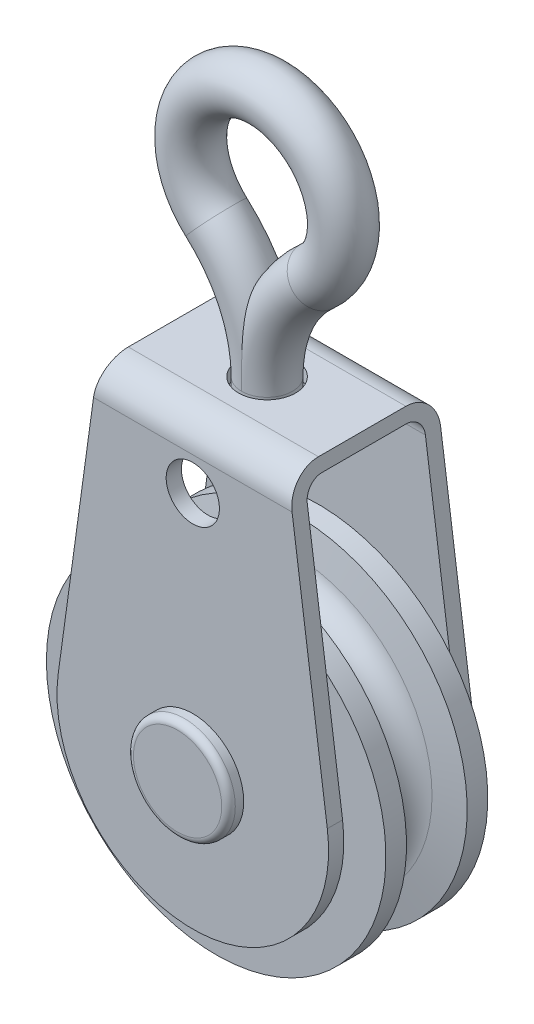
ISO-10303-21;
HEADER;
FILE_DESCRIPTION(('STEP AP214'),'2;1');
FILE_NAME('part.step','',(''),(''),'','','');
FILE_SCHEMA(('AUTOMOTIVE_DESIGN { 1 0 10303 214 1 1 1 1 }'));
ENDSEC;
DATA;
#1=APPLICATION_CONTEXT('core data for automotive mechanical design processes');
#2=APPLICATION_PROTOCOL_DEFINITION('international standard','automotive_design',2000,#1);
#3=PRODUCT_CONTEXT('',#1,'mechanical');
#4=PRODUCT('Part','Part','',(#3));
#5=PRODUCT_RELATED_PRODUCT_CATEGORY('part','',(#4));
#6=PRODUCT_DEFINITION_FORMATION('','',#4);
#7=PRODUCT_DEFINITION_CONTEXT('part definition',#1,'design');
#8=PRODUCT_DEFINITION('design','',#6,#7);
#9=PRODUCT_DEFINITION_SHAPE('','',#8);
#10=(LENGTH_UNIT() NAMED_UNIT(*) SI_UNIT(.MILLI.,.METRE.));
#11=(NAMED_UNIT(*) PLANE_ANGLE_UNIT() SI_UNIT($,.RADIAN.));
#12=(NAMED_UNIT(*) SI_UNIT($,.STERADIAN.) SOLID_ANGLE_UNIT());
#13=UNCERTAINTY_MEASURE_WITH_UNIT(LENGTH_MEASURE(1.E-05),#10,'distance_accuracy_value','');
#14=(GEOMETRIC_REPRESENTATION_CONTEXT(3) GLOBAL_UNCERTAINTY_ASSIGNED_CONTEXT((#13)) GLOBAL_UNIT_ASSIGNED_CONTEXT((#10,
#11,#12)) REPRESENTATION_CONTEXT('',''));
#15=CARTESIAN_POINT('',(0.,0.,0.));
#16=DIRECTION('',(0.,0.,1.));
#17=DIRECTION('',(1.,0.,0.));
#18=AXIS2_PLACEMENT_3D('',#15,#16,#17);
#19=CARTESIAN_POINT('',(0.,27.305,0.));
#20=DIRECTION('',(0.,-1.,0.));
#21=DIRECTION('',(0.,0.,-1.));
#22=AXIS2_PLACEMENT_3D('',#19,#20,#21);
#23=PLANE('',#22);
#24=CARTESIAN_POINT('',(0.,27.305,0.));
#25=DIRECTION('',(0.,1.,0.));
#26=DIRECTION('',(0.,0.,1.));
#27=AXIS2_PLACEMENT_3D('',#24,#25,#26);
#28=CIRCLE('',#27,2.667);
#29=CARTESIAN_POINT('',(0.,27.305,2.667));
#30=VERTEX_POINT('',#29);
#31=EDGE_CURVE('E225',#30,#30,#28,.T.);
#32=ORIENTED_EDGE('',*,*,#31,.T.);
#33=EDGE_LOOP('',(#32));
#34=FACE_BOUND('',#33,.T.);
#35=CARTESIAN_POINT('',(0.,27.305,0.));
#36=DIRECTION('',(0.,-1.,0.));
#37=DIRECTION('',(0.,0.,-1.));
#38=AXIS2_PLACEMENT_3D('',#35,#36,#37);
#39=CIRCLE('',#38,2.38125);
#40=CARTESIAN_POINT('',(0.,27.305,-2.38125));
#41=VERTEX_POINT('',#40);
#42=EDGE_CURVE('E11',#41,#41,#39,.F.);
#43=ORIENTED_EDGE('',*,*,#42,.F.);
#44=EDGE_LOOP('',(#43));
#45=FACE_BOUND('',#44,.T.);
#46=ADVANCED_FACE('F41',(#34,#45),#23,.F.);
#47=CARTESIAN_POINT('',(9.0646453448014,27.305,18.1737195122));
#48=DIRECTION('',(0.,1.,0.));
#49=DIRECTION('',(0.,0.,-1.));
#50=AXIS2_PLACEMENT_3D('',#47,#48,#49);
#51=PLANE('',#50);
#52=DIRECTION('',(-1.,0.,0.));
#53=VECTOR('',#52,1.);
#54=CARTESIAN_POINT('',(-9.0646453448014,27.305,3.937));
#55=LINE('',#54,#53);
#56=CARTESIAN_POINT('',(9.0646453448014,27.305,3.937));
#57=VERTEX_POINT('',#56);
#58=CARTESIAN_POINT('',(0.501006549358368,27.305,3.937));
#59=VERTEX_POINT('',#58);
#60=EDGE_CURVE('E282',#57,#59,#55,.T.);
#61=ORIENTED_EDGE('',*,*,#60,.T.);
#62=CARTESIAN_POINT('',(0.,27.305,0.));
#63=DIRECTION('',(0.,-1.,0.));
#64=DIRECTION('',(0.,0.,-1.));
#65=AXIS2_PLACEMENT_3D('',#62,#63,#64);
#66=CIRCLE('',#65,3.96875);
#67=CARTESIAN_POINT('',(0.501006549358367,27.305,-3.937));
#68=VERTEX_POINT('',#67);
#69=EDGE_CURVE('E62',#68,#59,#66,.T.);
#70=ORIENTED_EDGE('',*,*,#69,.F.);
#71=DIRECTION('',(-1.,0.,0.));
#72=VECTOR('',#71,1.);
#73=CARTESIAN_POINT('',(-9.0646453448014,27.305,-3.937));
#74=LINE('',#73,#72);
#75=CARTESIAN_POINT('',(9.0646453448014,27.305,-3.937));
#76=VERTEX_POINT('',#75);
#77=EDGE_CURVE('E236',#76,#68,#74,.T.);
#78=ORIENTED_EDGE('',*,*,#77,.F.);
#79=DIRECTION('',(0.,0.,-1.));
#80=VECTOR('',#79,1.);
#81=CARTESIAN_POINT('',(9.0646453448014,27.305,18.1737195122));
#82=LINE('',#81,#80);
#83=EDGE_CURVE('E224',#57,#76,#82,.T.);
#84=ORIENTED_EDGE('',*,*,#83,.F.);
#85=EDGE_LOOP('',(#61,#70,#78,#84));
#86=FACE_BOUND('',#85,.T.);
#87=ADVANCED_FACE('F280',(#86),#51,.F.);
#88=CARTESIAN_POINT('',(0.,0.,-17.5691305089622));
#89=DIRECTION('',(0.,0.,1.));
#90=DIRECTION('',(1.,0.,0.));
#91=AXIS2_PLACEMENT_3D('',#88,#89,#90);
#92=CYLINDRICAL_SURFACE('',#91,2.8575);
#93=CARTESIAN_POINT('',(0.,0.,-4.7625));
#94=DIRECTION('',(0.,0.,-1.));
#95=DIRECTION('',(-1.,0.,0.));
#96=AXIS2_PLACEMENT_3D('',#93,#94,#95);
#97=CIRCLE('',#96,2.8575);
#98=CARTESIAN_POINT('',(-2.8575,0.,-4.7625));
#99=VERTEX_POINT('',#98);
#100=EDGE_CURVE('E388',#99,#99,#97,.F.);
#101=ORIENTED_EDGE('',*,*,#100,.F.);
#102=EDGE_LOOP('',(#101));
#103=FACE_BOUND('',#102,.T.);
#104=CARTESIAN_POINT('',(0.,0.,-5.5245));
#105=DIRECTION('',(0.,0.,-1.));
#106=DIRECTION('',(-1.,0.,0.));
#107=AXIS2_PLACEMENT_3D('',#104,#105,#106);
#108=CIRCLE('',#107,2.8575);
#109=CARTESIAN_POINT('',(-2.8575,0.,-5.5245));
#110=VERTEX_POINT('',#109);
#111=EDGE_CURVE('E417',#110,#110,#108,.T.);
#112=ORIENTED_EDGE('',*,*,#111,.F.);
#113=EDGE_LOOP('',(#112));
#114=FACE_BOUND('',#113,.T.);
#115=ADVANCED_FACE('F482',(#103,#114),#92,.T.);
#116=CARTESIAN_POINT('',(-1.10854532508269E-13,-15.875,4.7625));
#117=DIRECTION('',(0.,0.,1.));
#118=DIRECTION('',(1.,0.,0.));
#119=AXIS2_PLACEMENT_3D('',#116,#117,#118);
#120=PLANE('',#119);
#121=CARTESIAN_POINT('',(0.,0.,4.7625));
#122=DIRECTION('',(0.,0.,-1.));
#123=DIRECTION('',(-1.,0.,0.));
#124=AXIS2_PLACEMENT_3D('',#121,#122,#123);
#125=CIRCLE('',#124,15.875);
#126=CARTESIAN_POINT('',(-15.875,0.,4.7625));
#127=VERTEX_POINT('',#126);
#128=EDGE_CURVE('E393',#127,#127,#125,.T.);
#129=ORIENTED_EDGE('',*,*,#128,.F.);
#130=EDGE_LOOP('',(#129));
#131=FACE_BOUND('',#130,.T.);
#132=CARTESIAN_POINT('',(0.,0.,4.7625));
#133=DIRECTION('',(0.,0.,1.));
#134=DIRECTION('',(1.,0.,0.));
#135=AXIS2_PLACEMENT_3D('',#132,#133,#134);
#136=CIRCLE('',#135,2.8575);
#137=CARTESIAN_POINT('',(2.8575,0.,4.7625));
#138=VERTEX_POINT('',#137);
#139=EDGE_CURVE('E389',#138,#138,#136,.F.);
#140=ORIENTED_EDGE('',*,*,#139,.T.);
#141=EDGE_LOOP('',(#140));
#142=FACE_BOUND('',#141,.T.);
#143=ADVANCED_FACE('F43',(#131,#142),#120,.T.);
#144=CARTESIAN_POINT('',(-1.10854532508269E-13,-15.875,-4.7625));
#145=DIRECTION('',(0.,0.,-1.));
#146=DIRECTION('',(-1.,0.,0.));
#147=AXIS2_PLACEMENT_3D('',#144,#145,#146);
#148=PLANE('',#147);
#149=CARTESIAN_POINT('',(0.,0.,-4.7625));
#150=DIRECTION('',(0.,0.,-1.));
#151=DIRECTION('',(-1.,0.,0.));
#152=AXIS2_PLACEMENT_3D('',#149,#150,#151);
#153=CIRCLE('',#152,15.875);
#154=CARTESIAN_POINT('',(-15.875,0.,-4.7625));
#155=VERTEX_POINT('',#154);
#156=EDGE_CURVE('E413',#155,#155,#153,.T.);
#157=ORIENTED_EDGE('',*,*,#156,.T.);
#158=EDGE_LOOP('',(#157));
#159=FACE_BOUND('',#158,.T.);
#160=ORIENTED_EDGE('',*,*,#100,.T.);
#161=EDGE_LOOP('',(#160));
#162=FACE_BOUND('',#161,.T.);
#163=ADVANCED_FACE('F718',(#159,#162),#148,.T.);
#164=CARTESIAN_POINT('',(0.,0.,-4.7625));
#165=DIRECTION('',(0.,0.,-1.));
#166=DIRECTION('',(-1.,0.,0.));
#167=AXIS2_PLACEMENT_3D('',#164,#165,#166);
#168=CYLINDRICAL_SURFACE('',#167,15.875);
#169=CARTESIAN_POINT('',(0.,0.,-2.83786324236497));
#170=DIRECTION('',(0.,0.,-1.));
#171=DIRECTION('',(-1.,0.,0.));
#172=AXIS2_PLACEMENT_3D('',#169,#170,#171);
#173=CIRCLE('',#172,15.875);
#174=CARTESIAN_POINT('',(-15.875,0.,-2.83786324236497));
#175=VERTEX_POINT('',#174);
#176=EDGE_CURVE('E409',#175,#175,#173,.T.);
#177=ORIENTED_EDGE('',*,*,#176,.T.);
#178=EDGE_LOOP('',(#177));
#179=FACE_BOUND('',#178,.T.);
#180=ORIENTED_EDGE('',*,*,#156,.F.);
#181=EDGE_LOOP('',(#180));
#182=FACE_BOUND('',#181,.T.);
#183=ADVANCED_FACE('F723',(#179,#182),#168,.T.);
#184=CARTESIAN_POINT('',(0.,0.,-2.83786324236497));
#185=DIRECTION('',(0.,0.,-1.));
#186=DIRECTION('',(-1.,0.,0.));
#187=AXIS2_PLACEMENT_3D('',#184,#185,#186);
#188=CONICAL_SURFACE('',#187,15.875,1.39626340159546);
#189=CARTESIAN_POINT('',(0.,0.,-2.34507346186032));
#190=DIRECTION('',(0.,0.,-1.));
#191=DIRECTION('',(-1.,0.,0.));
#192=AXIS2_PLACEMENT_3D('',#189,#190,#191);
#193=CIRCLE('',#192,13.0802502769306);
#194=CARTESIAN_POINT('',(-13.0802502769306,0.,-2.34507346186032));
#195=VERTEX_POINT('',#194);
#196=EDGE_CURVE('E405',#195,#195,#193,.T.);
#197=ORIENTED_EDGE('',*,*,#196,.T.);
#198=EDGE_LOOP('',(#197));
#199=FACE_BOUND('',#198,.T.);
#200=ORIENTED_EDGE('',*,*,#176,.F.);
#201=EDGE_LOOP('',(#200));
#202=FACE_BOUND('',#201,.T.);
#203=ADVANCED_FACE('F737',(#199,#202),#188,.T.);
#204=CARTESIAN_POINT('',(0.,0.,0.));
#205=DIRECTION('',(0.,0.,-1.));
#206=DIRECTION('',(-1.,0.,0.));
#207=AXIS2_PLACEMENT_3D('',#204,#205,#206);
#208=TOROIDAL_SURFACE('',#207,13.49375,2.38125);
#209=CARTESIAN_POINT('',(0.,0.,2.34507346186032));
#210=DIRECTION('',(0.,0.,-1.));
#211=DIRECTION('',(-1.,0.,0.));
#212=AXIS2_PLACEMENT_3D('',#209,#210,#211);
#213=CIRCLE('',#212,13.0802502769306);
#214=CARTESIAN_POINT('',(-13.0802502769306,0.,2.34507346186032));
#215=VERTEX_POINT('',#214);
#216=EDGE_CURVE('E401',#215,#215,#213,.T.);
#217=ORIENTED_EDGE('',*,*,#216,.T.);
#218=EDGE_LOOP('',(#217));
#219=FACE_BOUND('',#218,.T.);
#220=ORIENTED_EDGE('',*,*,#196,.F.);
#221=EDGE_LOOP('',(#220));
#222=FACE_BOUND('',#221,.T.);
#223=ADVANCED_FACE('F731',(#219,#222),#208,.F.);
#224=CARTESIAN_POINT('',(0.,0.,2.34507346186032));
#225=DIRECTION('',(0.,0.,1.));
#226=DIRECTION('',(1.,0.,0.));
#227=AXIS2_PLACEMENT_3D('',#224,#225,#226);
#228=CONICAL_SURFACE('',#227,13.0802502769306,1.39626340159546);
#229=CARTESIAN_POINT('',(0.,0.,2.83786324236497));
#230=DIRECTION('',(0.,0.,-1.));
#231=DIRECTION('',(-1.,0.,0.));
#232=AXIS2_PLACEMENT_3D('',#229,#230,#231);
#233=CIRCLE('',#232,15.875);
#234=CARTESIAN_POINT('',(-15.875,0.,2.83786324236497));
#235=VERTEX_POINT('',#234);
#236=EDGE_CURVE('E397',#235,#235,#233,.T.);
#237=ORIENTED_EDGE('',*,*,#236,.T.);
#238=EDGE_LOOP('',(#237));
#239=FACE_BOUND('',#238,.T.);
#240=ORIENTED_EDGE('',*,*,#216,.F.);
#241=EDGE_LOOP('',(#240));
#242=FACE_BOUND('',#241,.T.);
#243=ADVANCED_FACE('F709',(#239,#242),#228,.T.);
#244=CARTESIAN_POINT('',(0.,0.,-4.7625));
#245=DIRECTION('',(0.,0.,-1.));
#246=DIRECTION('',(-1.,0.,0.));
#247=AXIS2_PLACEMENT_3D('',#244,#245,#246);
#248=CYLINDRICAL_SURFACE('',#247,15.875);
#249=ORIENTED_EDGE('',*,*,#128,.T.);
#250=EDGE_LOOP('',(#249));
#251=FACE_BOUND('',#250,.T.);
#252=ORIENTED_EDGE('',*,*,#236,.F.);
#253=EDGE_LOOP('',(#252));
#254=FACE_BOUND('',#253,.T.);
#255=ADVANCED_FACE('F702',(#251,#254),#248,.T.);
#256=ORIENTED_EDGE('',*,*,#139,.F.);
#257=EDGE_LOOP('',(#256));
#258=FACE_BOUND('',#257,.T.);
#259=CARTESIAN_POINT('',(0.,0.,5.5245));
#260=DIRECTION('',(0.,0.,1.));
#261=DIRECTION('',(1.,0.,0.));
#262=AXIS2_PLACEMENT_3D('',#259,#260,#261);
#263=CIRCLE('',#262,2.8575);
#264=CARTESIAN_POINT('',(2.8575,0.,5.5245));
#265=VERTEX_POINT('',#264);
#266=EDGE_CURVE('E355',#265,#265,#263,.T.);
#267=ORIENTED_EDGE('',*,*,#266,.F.);
#268=EDGE_LOOP('',(#267));
#269=FACE_BOUND('',#268,.T.);
#270=ADVANCED_FACE('F677',(#258,#269),#92,.T.);
#271=CARTESIAN_POINT('',(0.,0.,-5.5245));
#272=DIRECTION('',(0.,0.,-1.));
#273=DIRECTION('',(1.,0.,0.));
#274=AXIS2_PLACEMENT_3D('',#271,#272,#273);
#275=PLANE('',#274);
#276=DIRECTION('',(-0.136233916157653,-0.990676698064686,0.));
#277=VECTOR('',#276,1.);
#278=CARTESIAN_POINT('',(-8.89,28.575,-5.5245));
#279=LINE('',#278,#277);
#280=CARTESIAN_POINT('',(-9.28295202580315,25.7175,-5.5245));
#281=VERTEX_POINT('',#280);
#282=CARTESIAN_POINT('',(-12.5815940654215,1.7301707352022,-5.5245));
#283=VERTEX_POINT('',#282);
#284=EDGE_CURVE('E237',#281,#283,#279,.T.);
#285=ORIENTED_EDGE('',*,*,#284,.T.);
#286=CARTESIAN_POINT('',(0.,0.,-5.5245));
#287=DIRECTION('',(0.,0.,1.));
#288=DIRECTION('',(1.,0.,0.));
#289=AXIS2_PLACEMENT_3D('',#286,#287,#288);
#290=CIRCLE('',#289,12.7);
#291=CARTESIAN_POINT('',(12.5815940654215,1.7301707352022,-5.5245));
#292=VERTEX_POINT('',#291);
#293=EDGE_CURVE('E219',#283,#292,#290,.T.);
#294=ORIENTED_EDGE('',*,*,#293,.T.);
#295=DIRECTION('',(-0.136233916157653,0.990676698064686,0.));
#296=VECTOR('',#295,1.);
#297=CARTESIAN_POINT('',(8.89,28.575,-5.5245));
#298=LINE('',#297,#296);
#299=CARTESIAN_POINT('',(9.28295202580315,25.7175,-5.5245));
#300=VERTEX_POINT('',#299);
#301=EDGE_CURVE('E214',#292,#300,#298,.T.);
#302=ORIENTED_EDGE('',*,*,#301,.T.);
#303=DIRECTION('',(-1.,0.,0.));
#304=VECTOR('',#303,1.);
#305=CARTESIAN_POINT('',(9.0646453448014,25.7175,-5.5245));
#306=LINE('',#305,#304);
#307=EDGE_CURVE('E243',#281,#300,#306,.F.);
#308=ORIENTED_EDGE('',*,*,#307,.F.);
#309=EDGE_LOOP('',(#285,#294,#302,#308));
#310=FACE_BOUND('',#309,.T.);
#311=CARTESIAN_POINT('',(0.,22.606,-5.5245));
#312=DIRECTION('',(0.,0.,1.));
#313=DIRECTION('',(1.,0.,0.));
#314=AXIS2_PLACEMENT_3D('',#311,#312,#313);
#315=CIRCLE('',#314,2.4892);
#316=CARTESIAN_POINT('',(2.4892,22.606,-5.5245));
#317=VERTEX_POINT('',#316);
#318=EDGE_CURVE('E231',#317,#317,#315,.T.);
#319=ORIENTED_EDGE('',*,*,#318,.F.);
#320=EDGE_LOOP('',(#319));
#321=FACE_BOUND('',#320,.T.);
#322=ORIENTED_EDGE('',*,*,#111,.T.);
#323=EDGE_LOOP('',(#322));
#324=FACE_BOUND('',#323,.T.);
#325=ADVANCED_FACE('F251',(#310,#321,#324),#275,.F.);
#326=CARTESIAN_POINT('',(0.,0.,-6.9469));
#327=DIRECTION('',(0.,0.,-1.));
#328=DIRECTION('',(1.,0.,0.));
#329=AXIS2_PLACEMENT_3D('',#326,#327,#328);
#330=PLANE('',#329);
#331=DIRECTION('',(-0.136233916157653,0.990676698064686,0.));
#332=VECTOR('',#331,1.);
#333=CARTESIAN_POINT('',(8.89,28.575,-6.9469));
#334=LINE('',#333,#332);
#335=CARTESIAN_POINT('',(12.5815940654215,1.7301707352022,-6.9469));
#336=VERTEX_POINT('',#335);
#337=CARTESIAN_POINT('',(9.28295202580315,25.7175,-6.9469));
#338=VERTEX_POINT('',#337);
#339=EDGE_CURVE('E195',#336,#338,#334,.T.);
#340=ORIENTED_EDGE('',*,*,#339,.F.);
#341=CARTESIAN_POINT('',(0.,0.,-6.9469));
#342=DIRECTION('',(0.,0.,1.));
#343=DIRECTION('',(1.,0.,0.));
#344=AXIS2_PLACEMENT_3D('',#341,#342,#343);
#345=CIRCLE('',#344,12.7);
#346=CARTESIAN_POINT('',(-12.5815940654215,1.7301707352022,-6.9469));
#347=VERTEX_POINT('',#346);
#348=EDGE_CURVE('E202',#347,#336,#345,.T.);
#349=ORIENTED_EDGE('',*,*,#348,.F.);
#350=DIRECTION('',(-0.136233916157653,-0.990676698064686,0.));
#351=VECTOR('',#350,1.);
#352=CARTESIAN_POINT('',(-8.89,28.575,-6.9469));
#353=LINE('',#352,#351);
#354=CARTESIAN_POINT('',(-9.28295202580315,25.7175,-6.9469));
#355=VERTEX_POINT('',#354);
#356=EDGE_CURVE('E218',#355,#347,#353,.T.);
#357=ORIENTED_EDGE('',*,*,#356,.F.);
#358=DIRECTION('',(-1.,0.,0.));
#359=VECTOR('',#358,1.);
#360=CARTESIAN_POINT('',(-8.89,25.7175,-6.9469));
#361=LINE('',#360,#359);
#362=EDGE_CURVE('E184',#338,#355,#361,.T.);
#363=ORIENTED_EDGE('',*,*,#362,.F.);
#364=EDGE_LOOP('',(#340,#349,#357,#363));
#365=FACE_BOUND('',#364,.T.);
#366=CARTESIAN_POINT('',(0.,22.606,-6.9469));
#367=DIRECTION('',(0.,0.,1.));
#368=DIRECTION('',(1.,0.,0.));
#369=AXIS2_PLACEMENT_3D('',#366,#367,#368);
#370=CIRCLE('',#369,2.4892);
#371=CARTESIAN_POINT('',(2.4892,22.606,-6.9469));
#372=VERTEX_POINT('',#371);
#373=EDGE_CURVE('E242',#372,#372,#370,.T.);
#374=ORIENTED_EDGE('',*,*,#373,.T.);
#375=EDGE_LOOP('',(#374));
#376=FACE_BOUND('',#375,.T.);
#377=CARTESIAN_POINT('',(0.,0.,-6.9469));
#378=DIRECTION('',(0.,0.,-1.));
#379=DIRECTION('',(-1.,0.,0.));
#380=AXIS2_PLACEMENT_3D('',#377,#378,#379);
#381=CIRCLE('',#380,2.8575);
#382=CARTESIAN_POINT('',(-2.8575,0.,-6.9469));
#383=VERTEX_POINT('',#382);
#384=EDGE_CURVE('E378',#383,#383,#381,.T.);
#385=ORIENTED_EDGE('',*,*,#384,.F.);
#386=EDGE_LOOP('',(#385));
#387=FACE_BOUND('',#386,.T.);
#388=ADVANCED_FACE('F375',(#365,#376,#387),#330,.T.);
#389=CARTESIAN_POINT('',(-8.89,28.575,-6.9469));
#390=DIRECTION('',(0.990676698064686,-0.136233916157653,0.));
#391=DIRECTION('',(0.136233916157653,0.990676698064686,0.));
#392=AXIS2_PLACEMENT_3D('',#389,#390,#391);
#393=PLANE('',#392);
#394=ORIENTED_EDGE('',*,*,#356,.T.);
#395=DIRECTION('',(0.,0.,1.));
#396=VECTOR('',#395,1.);
#397=CARTESIAN_POINT('',(-12.5815940654215,1.7301707352022,-6.9469));
#398=LINE('',#397,#396);
#399=EDGE_CURVE('E210',#347,#283,#398,.T.);
#400=ORIENTED_EDGE('',*,*,#399,.T.);
#401=ORIENTED_EDGE('',*,*,#284,.F.);
#402=CARTESIAN_POINT('',(-9.28295202580315,25.7175,-3.937));
#403=DIRECTION('',(-0.990676698064686,0.136233916157653,0.));
#404=DIRECTION('',(0.136233916157653,0.990676698064686,0.));
#405=AXIS2_PLACEMENT_3D('',#402,#403,#404);
#406=ELLIPSE('',#405,1.60244003225394,1.5875);
#407=CARTESIAN_POINT('',(-9.0646453448014,27.305,-3.937));
#408=VERTEX_POINT('',#407);
#409=EDGE_CURVE('E270',#408,#281,#406,.T.);
#410=ORIENTED_EDGE('',*,*,#409,.F.);
#411=DIRECTION('',(0.,0.,-1.));
#412=VECTOR('',#411,1.);
#413=CARTESIAN_POINT('',(-9.0646453448014,27.305,18.1737195122));
#414=LINE('',#413,#412);
#415=CARTESIAN_POINT('',(-9.0646453448014,27.305,3.937));
#416=VERTEX_POINT('',#415);
#417=EDGE_CURVE('E220',#416,#408,#414,.T.);
#418=ORIENTED_EDGE('',*,*,#417,.F.);
#419=CARTESIAN_POINT('',(-9.28295202580315,25.7175,3.937));
#420=DIRECTION('',(0.990676698064686,-0.136233916157653,0.));
#421=DIRECTION('',(0.136233916157653,0.990676698064686,0.));
#422=AXIS2_PLACEMENT_3D('',#419,#420,#421);
#423=ELLIPSE('',#422,1.60244003225394,1.5875);
#424=CARTESIAN_POINT('',(-9.28295202580315,25.7175,5.5245));
#425=VERTEX_POINT('',#424);
#426=EDGE_CURVE('E329',#416,#425,#423,.T.);
#427=ORIENTED_EDGE('',*,*,#426,.T.);
#428=DIRECTION('',(-0.136233916157653,-0.990676698064686,0.));
#429=VECTOR('',#428,1.);
#430=CARTESIAN_POINT('',(-8.89,28.575,5.5245));
#431=LINE('',#430,#429);
#432=CARTESIAN_POINT('',(-12.5815940654215,1.7301707352022,5.5245));
#433=VERTEX_POINT('',#432);
#434=EDGE_CURVE('E300',#425,#433,#431,.T.);
#435=ORIENTED_EDGE('',*,*,#434,.T.);
#436=DIRECTION('',(0.,0.,-1.));
#437=VECTOR('',#436,1.);
#438=CARTESIAN_POINT('',(-12.5815940654215,1.7301707352022,6.9469));
#439=LINE('',#438,#437);
#440=CARTESIAN_POINT('',(-12.5815940654215,1.7301707352022,6.9469));
#441=VERTEX_POINT('',#440);
#442=EDGE_CURVE('E915',#441,#433,#439,.T.);
#443=ORIENTED_EDGE('',*,*,#442,.F.);
#444=DIRECTION('',(-0.136233916157653,-0.990676698064686,0.));
#445=VECTOR('',#444,1.);
#446=CARTESIAN_POINT('',(-8.89,28.575,6.9469));
#447=LINE('',#446,#445);
#448=CARTESIAN_POINT('',(-9.28295202580315,25.7175,6.9469));
#449=VERTEX_POINT('',#448);
#450=EDGE_CURVE('E304',#449,#441,#447,.T.);
#451=ORIENTED_EDGE('',*,*,#450,.F.);
#452=CARTESIAN_POINT('',(-9.28295202580315,25.7175,4.0894));
#453=DIRECTION('',(0.990676698064686,-0.136233916157653,0.));
#454=DIRECTION('',(0.136233916157653,0.990676698064686,0.));
#455=AXIS2_PLACEMENT_3D('',#452,#453,#454);
#456=ELLIPSE('',#455,2.88439205805709,2.8575);
#457=CARTESIAN_POINT('',(-8.89,28.575,4.0894));
#458=VERTEX_POINT('',#457);
#459=EDGE_CURVE('E192',#449,#458,#456,.F.);
#460=ORIENTED_EDGE('',*,*,#459,.T.);
#461=DIRECTION('',(0.,0.,1.));
#462=VECTOR('',#461,1.);
#463=CARTESIAN_POINT('',(-8.89,28.575,-6.9469));
#464=LINE('',#463,#462);
#465=CARTESIAN_POINT('',(-8.89,28.575,-4.0894));
#466=VERTEX_POINT('',#465);
#467=EDGE_CURVE('E172',#466,#458,#464,.T.);
#468=ORIENTED_EDGE('',*,*,#467,.F.);
#469=CARTESIAN_POINT('',(-9.28295202580315,25.7175,-4.0894));
#470=DIRECTION('',(-0.990676698064686,0.136233916157653,0.));
#471=DIRECTION('',(0.136233916157653,0.990676698064686,0.));
#472=AXIS2_PLACEMENT_3D('',#469,#470,#471);
#473=ELLIPSE('',#472,2.88439205805709,2.8575);
#474=EDGE_CURVE('E179',#355,#466,#473,.F.);
#475=ORIENTED_EDGE('',*,*,#474,.F.);
#476=EDGE_LOOP('',(#394,#400,#401,#410,#418,#427,#435,#443,#451,#460,#468,#475));
#477=FACE_BOUND('',#476,.T.);
#478=ADVANCED_FACE('F190',(#477),#393,.F.);
#479=CARTESIAN_POINT('',(0.,0.,-6.9469));
#480=DIRECTION('',(0.,0.,1.));
#481=DIRECTION('',(-1.,0.,0.));
#482=AXIS2_PLACEMENT_3D('',#479,#480,#481);
#483=CYLINDRICAL_SURFACE('',#482,12.7);
#484=ORIENTED_EDGE('',*,*,#293,.F.);
#485=ORIENTED_EDGE('',*,*,#399,.F.);
#486=ORIENTED_EDGE('',*,*,#348,.T.);
#487=DIRECTION('',(0.,0.,1.));
#488=VECTOR('',#487,1.);
#489=CARTESIAN_POINT('',(12.5815940654215,1.7301707352022,-6.9469));
#490=LINE('',#489,#488);
#491=EDGE_CURVE('E199',#336,#292,#490,.T.);
#492=ORIENTED_EDGE('',*,*,#491,.T.);
#493=EDGE_LOOP('',(#484,#485,#486,#492));
#494=FACE_BOUND('',#493,.T.);
#495=ADVANCED_FACE('F257',(#494),#483,.T.);
#496=CARTESIAN_POINT('',(8.89,28.575,-6.9469));
#497=DIRECTION('',(-0.990676698064686,-0.136233916157653,0.));
#498=DIRECTION('',(0.136233916157653,-0.990676698064686,0.));
#499=AXIS2_PLACEMENT_3D('',#496,#497,#498);
#500=PLANE('',#499);
#501=DIRECTION('',(0.,0.,1.));
#502=VECTOR('',#501,1.);
#503=CARTESIAN_POINT('',(8.89,28.575,-6.9469));
#504=LINE('',#503,#502);
#505=CARTESIAN_POINT('',(8.89,28.575,-4.0894));
#506=VERTEX_POINT('',#505);
#507=CARTESIAN_POINT('',(8.89,28.575,4.0894));
#508=VERTEX_POINT('',#507);
#509=EDGE_CURVE('E174',#506,#508,#504,.T.);
#510=ORIENTED_EDGE('',*,*,#509,.T.);
#511=CARTESIAN_POINT('',(9.28295202580315,25.7175,4.0894));
#512=DIRECTION('',(-0.990676698064686,-0.136233916157653,0.));
#513=DIRECTION('',(0.136233916157653,-0.990676698064686,0.));
#514=AXIS2_PLACEMENT_3D('',#511,#512,#513);
#515=ELLIPSE('',#514,2.88439205805709,2.8575);
#516=CARTESIAN_POINT('',(9.28295202580315,25.7175,6.9469));
#517=VERTEX_POINT('',#516);
#518=EDGE_CURVE('E344',#508,#517,#515,.F.);
#519=ORIENTED_EDGE('',*,*,#518,.T.);
#520=DIRECTION('',(-0.136233916157653,0.990676698064686,0.));
#521=VECTOR('',#520,1.);
#522=CARTESIAN_POINT('',(8.89,28.575,6.9469));
#523=LINE('',#522,#521);
#524=CARTESIAN_POINT('',(12.5815940654215,1.7301707352022,6.9469));
#525=VERTEX_POINT('',#524);
#526=EDGE_CURVE('E311',#525,#517,#523,.T.);
#527=ORIENTED_EDGE('',*,*,#526,.F.);
#528=DIRECTION('',(0.,0.,-1.));
#529=VECTOR('',#528,1.);
#530=CARTESIAN_POINT('',(12.5815940654215,1.7301707352022,6.9469));
#531=LINE('',#530,#529);
#532=CARTESIAN_POINT('',(12.5815940654215,1.7301707352022,5.5245));
#533=VERTEX_POINT('',#532);
#534=EDGE_CURVE('E315',#525,#533,#531,.T.);
#535=ORIENTED_EDGE('',*,*,#534,.T.);
#536=DIRECTION('',(-0.136233916157653,0.990676698064686,0.));
#537=VECTOR('',#536,1.);
#538=CARTESIAN_POINT('',(8.89,28.575,5.5245));
#539=LINE('',#538,#537);
#540=CARTESIAN_POINT('',(9.28295202580315,25.7175,5.5245));
#541=VERTEX_POINT('',#540);
#542=EDGE_CURVE('E308',#533,#541,#539,.T.);
#543=ORIENTED_EDGE('',*,*,#542,.T.);
#544=CARTESIAN_POINT('',(9.28295202580315,25.7175,3.937));
#545=DIRECTION('',(-0.990676698064686,-0.136233916157653,0.));
#546=DIRECTION('',(0.136233916157653,-0.990676698064686,0.));
#547=AXIS2_PLACEMENT_3D('',#544,#545,#546);
#548=ELLIPSE('',#547,1.60244003225394,1.5875);
#549=EDGE_CURVE('E332',#541,#57,#548,.T.);
#550=ORIENTED_EDGE('',*,*,#549,.T.);
#551=ORIENTED_EDGE('',*,*,#83,.T.);
#552=CARTESIAN_POINT('',(9.28295202580315,25.7175,-3.937));
#553=DIRECTION('',(0.990676698064686,0.136233916157653,0.));
#554=DIRECTION('',(0.136233916157653,-0.990676698064686,0.));
#555=AXIS2_PLACEMENT_3D('',#552,#553,#554);
#556=ELLIPSE('',#555,1.60244003225394,1.5875);
#557=EDGE_CURVE('E264',#300,#76,#556,.T.);
#558=ORIENTED_EDGE('',*,*,#557,.F.);
#559=ORIENTED_EDGE('',*,*,#301,.F.);
#560=ORIENTED_EDGE('',*,*,#491,.F.);
#561=ORIENTED_EDGE('',*,*,#339,.T.);
#562=CARTESIAN_POINT('',(9.28295202580315,25.7175,-4.0894));
#563=DIRECTION('',(0.990676698064686,0.136233916157653,0.));
#564=DIRECTION('',(0.136233916157653,-0.990676698064686,0.));
#565=AXIS2_PLACEMENT_3D('',#562,#563,#564);
#566=ELLIPSE('',#565,2.88439205805709,2.8575);
#567=EDGE_CURVE('E178',#506,#338,#566,.F.);
#568=ORIENTED_EDGE('',*,*,#567,.F.);
#569=EDGE_LOOP('',(#510,#519,#527,#535,#543,#550,#551,#558,#559,#560,#561,#568));
#570=FACE_BOUND('',#569,.T.);
#571=ADVANCED_FACE('F262',(#570),#500,.F.);
#572=CARTESIAN_POINT('',(-8.89,28.575,-6.9469));
#573=DIRECTION('',(0.,-1.,0.));
#574=DIRECTION('',(0.,0.,1.));
#575=AXIS2_PLACEMENT_3D('',#572,#573,#574);
#576=PLANE('',#575);
#577=ORIENTED_EDGE('',*,*,#467,.T.);
#578=DIRECTION('',(-1.,0.,0.));
#579=VECTOR('',#578,1.);
#580=CARTESIAN_POINT('',(8.89,28.575,4.0894));
#581=LINE('',#580,#579);
#582=EDGE_CURVE('E341',#458,#508,#581,.F.);
#583=ORIENTED_EDGE('',*,*,#582,.T.);
#584=ORIENTED_EDGE('',*,*,#509,.F.);
#585=DIRECTION('',(-1.,0.,0.));
#586=VECTOR('',#585,1.);
#587=CARTESIAN_POINT('',(8.89,28.575,-4.0894));
#588=LINE('',#587,#586);
#589=EDGE_CURVE('E166',#466,#506,#588,.F.);
#590=ORIENTED_EDGE('',*,*,#589,.F.);
#591=EDGE_LOOP('',(#577,#583,#584,#590));
#592=FACE_BOUND('',#591,.T.);
#593=CARTESIAN_POINT('',(0.,28.575,0.));
#594=DIRECTION('',(0.,1.,0.));
#595=DIRECTION('',(0.,0.,1.));
#596=AXIS2_PLACEMENT_3D('',#593,#594,#595);
#597=CIRCLE('',#596,2.667);
#598=CARTESIAN_POINT('',(0.,28.575,2.667));
#599=VERTEX_POINT('',#598);
#600=EDGE_CURVE('E359',#599,#599,#597,.T.);
#601=ORIENTED_EDGE('',*,*,#600,.F.);
#602=EDGE_LOOP('',(#601));
#603=FACE_BOUND('',#602,.T.);
#604=ADVANCED_FACE('F168',(#592,#603),#576,.F.);
#605=CARTESIAN_POINT('',(0.,22.606,-6.9469));
#606=DIRECTION('',(0.,0.,1.));
#607=DIRECTION('',(-1.,0.,0.));
#608=AXIS2_PLACEMENT_3D('',#605,#606,#607);
#609=CYLINDRICAL_SURFACE('',#608,2.4892);
#610=ORIENTED_EDGE('',*,*,#373,.F.);
#611=EDGE_LOOP('',(#610));
#612=FACE_BOUND('',#611,.T.);
#613=ORIENTED_EDGE('',*,*,#318,.T.);
#614=EDGE_LOOP('',(#613));
#615=FACE_BOUND('',#614,.T.);
#616=ADVANCED_FACE('F596',(#612,#615),#609,.F.);
#617=CARTESIAN_POINT('',(-0.501006549358367,27.305,-3.937));
#618=VERTEX_POINT('',#617);
#619=EDGE_CURVE('E213',#618,#408,#74,.T.);
#620=ORIENTED_EDGE('',*,*,#619,.F.);
#621=CARTESIAN_POINT('',(-0.501006549358367,27.305,3.937));
#622=VERTEX_POINT('',#621);
#623=EDGE_CURVE('E75',#622,#618,#66,.T.);
#624=ORIENTED_EDGE('',*,*,#623,.F.);
#625=EDGE_CURVE('E324',#622,#416,#55,.T.);
#626=ORIENTED_EDGE('',*,*,#625,.T.);
#627=ORIENTED_EDGE('',*,*,#417,.T.);
#628=EDGE_LOOP('',(#620,#624,#626,#627));
#629=FACE_BOUND('',#628,.T.);
#630=ADVANCED_FACE('F484',(#629),#51,.F.);
#631=CARTESIAN_POINT('',(9.0646453448014,25.7175,-3.937));
#632=DIRECTION('',(1.,0.,0.));
#633=DIRECTION('',(0.,0.,1.));
#634=AXIS2_PLACEMENT_3D('',#631,#632,#633);
#635=CYLINDRICAL_SURFACE('',#634,1.5875);
#636=ORIENTED_EDGE('',*,*,#77,.T.);
#637=CARTESIAN_POINT('',(-0.501006549358367,27.305,-3.937));
#638=CARTESIAN_POINT('',(-0.417786033678549,27.3049736031155,-3.94759387625657));
#639=CARTESIAN_POINT('',(-0.334229271398673,27.3048939553519,-3.95554196113234));
#640=CARTESIAN_POINT('',(-0.167114115544215,27.3047484147201,-3.96610945926799));
#641=CARTESIAN_POINT('',(-0.0835570577721077,27.3046824682563,-3.96875));
#642=CARTESIAN_POINT('',(0.0835570577721076,27.3046824682563,-3.96875));
#643=CARTESIAN_POINT('',(0.167114115544215,27.3047484147201,-3.96610945926799));
#644=CARTESIAN_POINT('',(0.334229271398673,27.3048939553519,-3.95554196113234));
#645=CARTESIAN_POINT('',(0.417786033678549,27.3049736031155,-3.94759387625657));
#646=CARTESIAN_POINT('',(0.501006549358367,27.305,-3.937));
#647=B_SPLINE_CURVE_WITH_KNOTS('',3,(#637,#638,#639,#640,#641,#642,#643,#644,#645,#646),
.UNSPECIFIED.,.F.,.F.,(4,2,2,2,4),(0.,0.251633394744423,0.502263125579979,0.752892856415535,
1.00452625115996),.UNSPECIFIED.);
#648=EDGE_CURVE('E86',#618,#68,#647,.T.);
#649=ORIENTED_EDGE('',*,*,#648,.F.);
#650=ORIENTED_EDGE('',*,*,#619,.T.);
#651=ORIENTED_EDGE('',*,*,#409,.T.);
#652=ORIENTED_EDGE('',*,*,#307,.T.);
#653=ORIENTED_EDGE('',*,*,#557,.T.);
#654=EDGE_LOOP('',(#636,#649,#650,#651,#652,#653));
#655=FACE_BOUND('',#654,.T.);
#656=ADVANCED_FACE('F272',(#655),#635,.F.);
#657=CARTESIAN_POINT('',(0.,25.7175,-4.0894));
#658=DIRECTION('',(1.,0.,0.));
#659=DIRECTION('',(0.,0.,1.));
#660=AXIS2_PLACEMENT_3D('',#657,#658,#659);
#661=CYLINDRICAL_SURFACE('',#660,2.8575);
#662=ORIENTED_EDGE('',*,*,#567,.T.);
#663=ORIENTED_EDGE('',*,*,#362,.T.);
#664=ORIENTED_EDGE('',*,*,#474,.T.);
#665=ORIENTED_EDGE('',*,*,#589,.T.);
#666=EDGE_LOOP('',(#662,#663,#664,#665));
#667=FACE_BOUND('',#666,.T.);
#668=ADVANCED_FACE('F182',(#667),#661,.T.);
#669=CARTESIAN_POINT('',(0.,27.305,0.));
#670=DIRECTION('',(0.,1.,0.));
#671=DIRECTION('',(0.,0.,1.));
#672=AXIS2_PLACEMENT_3D('',#669,#670,#671);
#673=CYLINDRICAL_SURFACE('',#672,2.667);
#674=ORIENTED_EDGE('',*,*,#31,.F.);
#675=EDGE_LOOP('',(#674));
#676=FACE_BOUND('',#675,.T.);
#677=ORIENTED_EDGE('',*,*,#600,.T.);
#678=EDGE_LOOP('',(#677));
#679=FACE_BOUND('',#678,.T.);
#680=ADVANCED_FACE('F644',(#676,#679),#673,.F.);
#681=CARTESIAN_POINT('',(0.,0.,-8.2169));
#682=DIRECTION('',(0.,0.,-1.));
#683=DIRECTION('',(1.,0.,0.));
#684=AXIS2_PLACEMENT_3D('',#681,#682,#683);
#685=PLANE('',#684);
#686=CARTESIAN_POINT('',(0.,0.,-8.2169));
#687=DIRECTION('',(0.,0.,-1.));
#688=DIRECTION('',(-1.,0.,0.));
#689=AXIS2_PLACEMENT_3D('',#686,#687,#688);
#690=CIRCLE('',#689,2.8575);
#691=CARTESIAN_POINT('',(-2.8575,0.,-8.2169));
#692=VERTEX_POINT('',#691);
#693=EDGE_CURVE('E382',#692,#692,#690,.T.);
#694=ORIENTED_EDGE('',*,*,#693,.T.);
#695=EDGE_LOOP('',(#694));
#696=FACE_BOUND('',#695,.T.);
#697=ADVANCED_FACE('F650',(#696),#685,.T.);
#698=ORIENTED_EDGE('',*,*,#384,.T.);
#699=EDGE_LOOP('',(#698));
#700=FACE_BOUND('',#699,.T.);
#701=ORIENTED_EDGE('',*,*,#693,.F.);
#702=EDGE_LOOP('',(#701));
#703=FACE_BOUND('',#702,.T.);
#704=ADVANCED_FACE('F471',(#700,#703),#92,.T.);
#705=CARTESIAN_POINT('',(0.,0.,5.5245));
#706=DIRECTION('',(0.,0.,1.));
#707=DIRECTION('',(1.,0.,0.));
#708=AXIS2_PLACEMENT_3D('',#705,#706,#707);
#709=PLANE('',#708);
#710=ORIENTED_EDGE('',*,*,#434,.F.);
#711=DIRECTION('',(-1.,0.,0.));
#712=VECTOR('',#711,1.);
#713=CARTESIAN_POINT('',(9.0646453448014,25.7175,5.5245));
#714=LINE('',#713,#712);
#715=EDGE_CURVE('E326',#425,#541,#714,.F.);
#716=ORIENTED_EDGE('',*,*,#715,.T.);
#717=ORIENTED_EDGE('',*,*,#542,.F.);
#718=CARTESIAN_POINT('',(0.,0.,5.5245));
#719=DIRECTION('',(0.,0.,1.));
#720=DIRECTION('',(1.,0.,0.));
#721=AXIS2_PLACEMENT_3D('',#718,#719,#720);
#722=CIRCLE('',#721,12.7);
#723=EDGE_CURVE('E318',#433,#533,#722,.T.);
#724=ORIENTED_EDGE('',*,*,#723,.F.);
#725=EDGE_LOOP('',(#710,#716,#717,#724));
#726=FACE_BOUND('',#725,.T.);
#727=CARTESIAN_POINT('',(0.,22.606,5.5245));
#728=DIRECTION('',(0.,0.,1.));
#729=DIRECTION('',(1.,0.,0.));
#730=AXIS2_PLACEMENT_3D('',#727,#728,#729);
#731=CIRCLE('',#730,2.4892);
#732=CARTESIAN_POINT('',(2.4892,22.606,5.5245));
#733=VERTEX_POINT('',#732);
#734=EDGE_CURVE('E295',#733,#733,#731,.T.);
#735=ORIENTED_EDGE('',*,*,#734,.T.);
#736=EDGE_LOOP('',(#735));
#737=FACE_BOUND('',#736,.T.);
#738=ORIENTED_EDGE('',*,*,#266,.T.);
#739=EDGE_LOOP('',(#738));
#740=FACE_BOUND('',#739,.T.);
#741=ADVANCED_FACE('F468',(#726,#737,#740),#709,.F.);
#742=CARTESIAN_POINT('',(0.,0.,6.9469));
#743=DIRECTION('',(0.,0.,1.));
#744=DIRECTION('',(1.,0.,0.));
#745=AXIS2_PLACEMENT_3D('',#742,#743,#744);
#746=PLANE('',#745);
#747=CARTESIAN_POINT('',(0.,22.606,6.9469));
#748=DIRECTION('',(0.,0.,1.));
#749=DIRECTION('',(1.,0.,0.));
#750=AXIS2_PLACEMENT_3D('',#747,#748,#749);
#751=CIRCLE('',#750,2.4892);
#752=CARTESIAN_POINT('',(2.4892,22.606,6.9469));
#753=VERTEX_POINT('',#752);
#754=EDGE_CURVE('E296',#753,#753,#751,.T.);
#755=ORIENTED_EDGE('',*,*,#754,.F.);
#756=EDGE_LOOP('',(#755));
#757=FACE_BOUND('',#756,.T.);
#758=ORIENTED_EDGE('',*,*,#526,.T.);
#759=DIRECTION('',(-1.,0.,0.));
#760=VECTOR('',#759,1.);
#761=CARTESIAN_POINT('',(-8.89,25.7175,6.9469));
#762=LINE('',#761,#760);
#763=EDGE_CURVE('E335',#517,#449,#762,.T.);
#764=ORIENTED_EDGE('',*,*,#763,.T.);
#765=ORIENTED_EDGE('',*,*,#450,.T.);
#766=CARTESIAN_POINT('',(0.,0.,6.9469));
#767=DIRECTION('',(0.,0.,1.));
#768=DIRECTION('',(1.,0.,0.));
#769=AXIS2_PLACEMENT_3D('',#766,#767,#768);
#770=CIRCLE('',#769,12.7);
#771=EDGE_CURVE('E307',#441,#525,#770,.T.);
#772=ORIENTED_EDGE('',*,*,#771,.T.);
#773=EDGE_LOOP('',(#758,#764,#765,#772));
#774=FACE_BOUND('',#773,.T.);
#775=CARTESIAN_POINT('',(0.,0.,6.9469));
#776=DIRECTION('',(0.,0.,1.));
#777=DIRECTION('',(1.,0.,0.));
#778=AXIS2_PLACEMENT_3D('',#775,#776,#777);
#779=CIRCLE('',#778,4.7625);
#780=CARTESIAN_POINT('',(4.7625,0.,6.9469));
#781=VERTEX_POINT('',#780);
#782=EDGE_CURVE('E287',#781,#781,#779,.T.);
#783=ORIENTED_EDGE('',*,*,#782,.F.);
#784=EDGE_LOOP('',(#783));
#785=FACE_BOUND('',#784,.T.);
#786=ADVANCED_FACE('F465',(#757,#774,#785),#746,.T.);
#787=CARTESIAN_POINT('',(0.,0.,6.9469));
#788=DIRECTION('',(0.,0.,-1.));
#789=DIRECTION('',(-1.,0.,0.));
#790=AXIS2_PLACEMENT_3D('',#787,#788,#789);
#791=CYLINDRICAL_SURFACE('',#790,12.7);
#792=ORIENTED_EDGE('',*,*,#723,.T.);
#793=ORIENTED_EDGE('',*,*,#534,.F.);
#794=ORIENTED_EDGE('',*,*,#771,.F.);
#795=ORIENTED_EDGE('',*,*,#442,.T.);
#796=EDGE_LOOP('',(#792,#793,#794,#795));
#797=FACE_BOUND('',#796,.T.);
#798=ADVANCED_FACE('F463',(#797),#791,.T.);
#799=CARTESIAN_POINT('',(0.,22.606,6.9469));
#800=DIRECTION('',(0.,0.,-1.));
#801=DIRECTION('',(-1.,0.,0.));
#802=AXIS2_PLACEMENT_3D('',#799,#800,#801);
#803=CYLINDRICAL_SURFACE('',#802,2.4892);
#804=ORIENTED_EDGE('',*,*,#754,.T.);
#805=EDGE_LOOP('',(#804));
#806=FACE_BOUND('',#805,.T.);
#807=ORIENTED_EDGE('',*,*,#734,.F.);
#808=EDGE_LOOP('',(#807));
#809=FACE_BOUND('',#808,.T.);
#810=ADVANCED_FACE('F460',(#806,#809),#803,.F.);
#811=CARTESIAN_POINT('',(9.0646453448014,25.7175,3.937));
#812=DIRECTION('',(1.,0.,0.));
#813=DIRECTION('',(0.,0.,-1.));
#814=AXIS2_PLACEMENT_3D('',#811,#812,#813);
#815=CYLINDRICAL_SURFACE('',#814,1.5875);
#816=ORIENTED_EDGE('',*,*,#625,.F.);
#817=CARTESIAN_POINT('',(-0.501006549358367,27.305,3.937));
#818=CARTESIAN_POINT('',(-0.417786033678549,27.3049736031155,3.94759387625657));
#819=CARTESIAN_POINT('',(-0.334229271398673,27.3048939553519,3.95554196113234));
#820=CARTESIAN_POINT('',(-0.167114115544215,27.3047484147201,3.96610945926799));
#821=CARTESIAN_POINT('',(-0.0835570577721075,27.3046824682563,3.96875));
#822=CARTESIAN_POINT('',(0.083557057772108,27.3046824682563,3.96875));
#823=CARTESIAN_POINT('',(0.167114115544216,27.3047484147201,3.96610945926799));
#824=CARTESIAN_POINT('',(0.334229271398673,27.3048939553519,3.95554196113234));
#825=CARTESIAN_POINT('',(0.417786033678549,27.3049736031155,3.94759387625657));
#826=CARTESIAN_POINT('',(0.501006549358368,27.305,3.937));
#827=B_SPLINE_CURVE_WITH_KNOTS('',3,(#817,#818,#819,#820,#821,#822,#823,#824,#825,#826),
.UNSPECIFIED.,.F.,.F.,(4,2,2,2,4),(0.,0.251633394744423,0.502263125579979,0.752892856415536,
1.00452625115996),.UNSPECIFIED.);
#828=EDGE_CURVE('E51',#622,#59,#827,.T.);
#829=ORIENTED_EDGE('',*,*,#828,.T.);
#830=ORIENTED_EDGE('',*,*,#60,.F.);
#831=ORIENTED_EDGE('',*,*,#549,.F.);
#832=ORIENTED_EDGE('',*,*,#715,.F.);
#833=ORIENTED_EDGE('',*,*,#426,.F.);
#834=EDGE_LOOP('',(#816,#829,#830,#831,#832,#833));
#835=FACE_BOUND('',#834,.T.);
#836=ADVANCED_FACE('F436',(#835),#815,.F.);
#837=CARTESIAN_POINT('',(0.,25.7175,4.0894));
#838=DIRECTION('',(1.,0.,0.));
#839=DIRECTION('',(0.,0.,-1.));
#840=AXIS2_PLACEMENT_3D('',#837,#838,#839);
#841=CYLINDRICAL_SURFACE('',#840,2.8575);
#842=ORIENTED_EDGE('',*,*,#518,.F.);
#843=ORIENTED_EDGE('',*,*,#582,.F.);
#844=ORIENTED_EDGE('',*,*,#459,.F.);
#845=ORIENTED_EDGE('',*,*,#763,.F.);
#846=EDGE_LOOP('',(#842,#843,#844,#845));
#847=FACE_BOUND('',#846,.T.);
#848=ADVANCED_FACE('F458',(#847),#841,.T.);
#849=CARTESIAN_POINT('',(0.,0.,8.3693));
#850=DIRECTION('',(0.,0.,-1.));
#851=DIRECTION('',(-1.,0.,0.));
#852=AXIS2_PLACEMENT_3D('',#849,#850,#851);
#853=CYLINDRICAL_SURFACE('',#852,4.7625);
#854=CARTESIAN_POINT('',(0.,0.,7.7343));
#855=DIRECTION('',(0.,0.,1.));
#856=DIRECTION('',(1.,0.,0.));
#857=AXIS2_PLACEMENT_3D('',#854,#855,#856);
#858=CIRCLE('',#857,4.7625);
#859=CARTESIAN_POINT('',(4.7625,0.,7.7343));
#860=VERTEX_POINT('',#859);
#861=EDGE_CURVE('E351',#860,#860,#858,.F.);
#862=ORIENTED_EDGE('',*,*,#861,.T.);
#863=EDGE_LOOP('',(#862));
#864=FACE_BOUND('',#863,.T.);
#865=ORIENTED_EDGE('',*,*,#782,.T.);
#866=EDGE_LOOP('',(#865));
#867=FACE_BOUND('',#866,.T.);
#868=ADVANCED_FACE('F454',(#864,#867),#853,.T.);
#869=CARTESIAN_POINT('',(0.,0.,8.3693));
#870=DIRECTION('',(0.,0.,1.));
#871=DIRECTION('',(1.,0.,0.));
#872=AXIS2_PLACEMENT_3D('',#869,#870,#871);
#873=PLANE('',#872);
#874=CARTESIAN_POINT('',(0.,0.,8.3693));
#875=DIRECTION('',(0.,0.,1.));
#876=DIRECTION('',(1.,0.,0.));
#877=AXIS2_PLACEMENT_3D('',#874,#875,#876);
#878=CIRCLE('',#877,4.1275);
#879=CARTESIAN_POINT('',(4.1275,0.,8.3693));
#880=VERTEX_POINT('',#879);
#881=EDGE_CURVE('E347',#880,#880,#878,.T.);
#882=ORIENTED_EDGE('',*,*,#881,.T.);
#883=EDGE_LOOP('',(#882));
#884=FACE_BOUND('',#883,.T.);
#885=ADVANCED_FACE('F449',(#884),#873,.T.);
#886=CARTESIAN_POINT('',(0.,0.,7.7343));
#887=DIRECTION('',(0.,0.,1.));
#888=DIRECTION('',(1.,0.,0.));
#889=AXIS2_PLACEMENT_3D('',#886,#887,#888);
#890=TOROIDAL_SURFACE('',#889,4.1275,0.635);
#891=ORIENTED_EDGE('',*,*,#861,.F.);
#892=EDGE_LOOP('',(#891));
#893=FACE_BOUND('',#892,.T.);
#894=ORIENTED_EDGE('',*,*,#881,.F.);
#895=EDGE_LOOP('',(#894));
#896=FACE_BOUND('',#895,.T.);
#897=ADVANCED_FACE('F453',(#893,#896),#890,.T.);
#898=CARTESIAN_POINT('',(0.,25.273,0.));
#899=DIRECTION('',(0.,-1.,0.));
#900=DIRECTION('',(0.,0.,-1.));
#901=AXIS2_PLACEMENT_3D('',#898,#899,#900);
#902=PLANE('',#901);
#903=CARTESIAN_POINT('',(0.,25.273,0.));
#904=DIRECTION('',(0.,-1.,0.));
#905=DIRECTION('',(0.,0.,-1.));
#906=AXIS2_PLACEMENT_3D('',#903,#904,#905);
#907=CIRCLE('',#906,3.96875);
#908=CARTESIAN_POINT('',(0.,25.273,-3.96875));
#909=VERTEX_POINT('',#908);
#910=EDGE_CURVE('E288',#909,#909,#907,.T.);
#911=ORIENTED_EDGE('',*,*,#910,.T.);
#912=EDGE_LOOP('',(#911));
#913=FACE_BOUND('',#912,.T.);
#914=ADVANCED_FACE('F446',(#913),#902,.T.);
#915=CARTESIAN_POINT('',(0.,27.305,0.));
#916=DIRECTION('',(0.,-1.,0.));
#917=DIRECTION('',(0.,0.,-1.));
#918=AXIS2_PLACEMENT_3D('',#915,#916,#917);
#919=CYLINDRICAL_SURFACE('',#918,3.96875);
#920=ORIENTED_EDGE('',*,*,#910,.F.);
#921=EDGE_LOOP('',(#920));
#922=FACE_BOUND('',#921,.T.);
#923=ORIENTED_EDGE('',*,*,#648,.T.);
#924=ORIENTED_EDGE('',*,*,#69,.T.);
#925=ORIENTED_EDGE('',*,*,#828,.F.);
#926=ORIENTED_EDGE('',*,*,#623,.T.);
#927=EDGE_LOOP('',(#923,#924,#925,#926));
#928=FACE_BOUND('',#927,.T.);
#929=ADVANCED_FACE('F440',(#922,#928),#919,.T.);
#930=CARTESIAN_POINT('',(0.,27.051,0.));
#931=DIRECTION('',(0.,1.,0.));
#932=DIRECTION('',(0.,0.,1.));
#933=AXIS2_PLACEMENT_3D('',#930,#931,#932);
#934=CYLINDRICAL_SURFACE('',#933,2.38125);
#935=CARTESIAN_POINT('',(0.,28.575,0.));
#936=DIRECTION('',(0.,1.,0.));
#937=DIRECTION('',(0.,0.,1.));
#938=AXIS2_PLACEMENT_3D('',#935,#936,#937);
#939=CIRCLE('',#938,2.38125);
#940=CARTESIAN_POINT('',(0.,28.575,2.38125));
#941=VERTEX_POINT('',#940);
#942=CARTESIAN_POINT('',(0.,28.575,-2.38125));
#943=VERTEX_POINT('',#942);
#944=EDGE_CURVE('E516',#941,#943,#939,.T.);
#945=ORIENTED_EDGE('',*,*,#944,.F.);
#946=EDGE_CURVE('E93',#943,#941,#939,.T.);
#947=ORIENTED_EDGE('',*,*,#946,.F.);
#948=EDGE_LOOP('',(#945,#947));
#949=FACE_BOUND('',#948,.T.);
#950=ORIENTED_EDGE('',*,*,#42,.T.);
#951=EDGE_LOOP('',(#950));
#952=FACE_BOUND('',#951,.T.);
#953=ADVANCED_FACE('F445',(#949,#952),#934,.T.);
#954=CARTESIAN_POINT('',(-14.0670138888889,28.575,0.));
#955=DIRECTION('',(0.,0.,-1.));
#956=DIRECTION('',(-1.,0.,0.));
#957=AXIS2_PLACEMENT_3D('',#954,#955,#956);
#958=TOROIDAL_SURFACE('',#957,14.0670138888889,2.38125);
#959=CARTESIAN_POINT('',(-4.73774688149688,39.1033264033264,0.));
#960=DIRECTION('',(-0.748440748440748,0.663201663201663,0.));
#961=DIRECTION('',(0.,0.,1.));
#962=AXIS2_PLACEMENT_3D('',#959,#960,#961);
#963=CIRCLE('',#962,2.38125);
#964=CARTESIAN_POINT('',(-6.31699584199584,37.3211018711019,0.));
#965=VERTEX_POINT('',#964);
#966=EDGE_CURVE('E519',#965,#965,#963,.T.);
#967=ORIENTED_EDGE('',*,*,#966,.F.);
#968=EDGE_LOOP('',(#967));
#969=FACE_BOUND('',#968,.T.);
#970=CARTESIAN_POINT('',(0.,28.575,-2.38125));
#971=CARTESIAN_POINT('',(0.,28.6029562205209,-2.3812501035456));
#972=CARTESIAN_POINT('',(0.,28.6309124411339,-2.38125006051981));
#973=CARTESIAN_POINT('',(0.,28.6868231117906,-2.38124991323527));
#974=CARTESIAN_POINT('',(0.,28.7147775618343,-2.38124980898041));
#975=CARTESIAN_POINT('',(0.,28.9411047980054,-2.38124965564285));
#976=CARTESIAN_POINT('',(0.,29.1394775795892,-2.38125381750739));
#977=CARTESIAN_POINT('',(0.,29.5362240696434,-2.38106676699714));
#978=CARTESIAN_POINT('',(0.,29.7345977781138,-2.38087555371705));
#979=CARTESIAN_POINT('',(0.,30.1314170663013,-2.37982803840539));
#980=CARTESIAN_POINT('',(0.,30.3298626456114,-2.37897149172714));
#981=CARTESIAN_POINT('',(0.,30.7267428948658,-2.37587251142866));
#982=CARTESIAN_POINT('',(0.,30.9251775649002,-2.37363009183284));
#983=CARTESIAN_POINT('',(0.,31.3225600104661,-2.3667854823966));
#984=CARTESIAN_POINT('',(0.,31.5215076857029,-2.36217677709435));
#985=CARTESIAN_POINT('',(0.,31.9193083489131,-2.34937729434193));
#986=CARTESIAN_POINT('',(0.,32.1181613300777,-2.34118628962888));
#987=CARTESIAN_POINT('',(0.,32.5154344475772,-2.31975054003734));
#988=CARTESIAN_POINT('',(0.,32.7138548103905,-2.30651022260959));
#989=CARTESIAN_POINT('',(0.,33.1101064852405,-2.2731987217976));
#990=CARTESIAN_POINT('',(0.,33.3079378968531,-2.25312876807403));
#991=CARTESIAN_POINT('',(0.,33.7055600007077,-2.20362131905434));
#992=CARTESIAN_POINT('',(0.,33.9053340092047,-2.17404445267486));
#993=CARTESIAN_POINT('',(0.,34.3029554149719,-2.10279203139936));
#994=CARTESIAN_POINT('',(0.,34.5008008513138,-2.06110526919722));
#995=CARTESIAN_POINT('',(0.,34.891460310667,-1.9623635172063));
#996=CARTESIAN_POINT('',(0.,35.0842984059794,-1.90540843264233));
#997=CARTESIAN_POINT('',(0.,35.3680673136871,-1.80495382131739));
#998=CARTESIAN_POINT('',(0.,35.461670182668,-1.76899973730204));
#999=CARTESIAN_POINT('',(0.,35.6464455675672,-1.69134281215296));
#1000=CARTESIAN_POINT('',(0.,35.7376186928887,-1.64964142900323));
#1001=CARTESIAN_POINT('',(0.,35.9638735409051,-1.53598472360157));
#1002=CARTESIAN_POINT('',(0.,36.0968166284198,-1.45965599528665));
#1003=CARTESIAN_POINT('',(0.,36.3501654095611,-1.28832377070474));
#1004=CARTESIAN_POINT('',(0.,36.4706006010375,-1.19336581180074));
#1005=CARTESIAN_POINT('',(0.,36.6477190609596,-1.02268008436463));
#1006=CARTESIAN_POINT('',(0.,36.7109859342545,-0.953825419886116));
#1007=CARTESIAN_POINT('',(0.,36.8267008519827,-0.80748298313407));
#1008=CARTESIAN_POINT('',(0.,36.8791616003743,-0.730005515097583));
#1009=CARTESIAN_POINT('',(0.,36.9615605494179,-0.581399304276713));
#1010=CARTESIAN_POINT('',(0.,36.9938433170714,-0.511582824768311));
#1011=CARTESIAN_POINT('',(0.,37.0463904802898,-0.367541299965203));
#1012=CARTESIAN_POINT('',(0.,37.0666652015246,-0.293320102877233));
#1013=CARTESIAN_POINT('',(0.,37.0935404206827,-0.14193367132792));
#1014=CARTESIAN_POINT('',(0.,37.1000586372337,-0.0647535175661057));
#1015=CARTESIAN_POINT('',(0.,37.0985132834688,0.0894597728390753));
#1016=CARTESIAN_POINT('',(0.,37.0904503793406,0.166492916038145));
#1017=CARTESIAN_POINT('',(0.,37.061955903261,0.31073467497343));
#1018=CARTESIAN_POINT('',(0.,37.0427424308238,0.378191335042664));
#1019=CARTESIAN_POINT('',(0.,36.9943839947947,0.509405555648604));
#1020=CARTESIAN_POINT('',(0.,36.9652356196571,0.573161836699467));
#1021=CARTESIAN_POINT('',(0.,36.8836917400718,0.723769237977773));
#1022=CARTESIAN_POINT('',(0.,36.8267337996929,0.808146156960582));
#1023=CARTESIAN_POINT('',(0.,36.7001373837926,0.966773975939515));
#1024=CARTESIAN_POINT('',(0.,36.6304679294642,1.04099934531902));
#1025=CARTESIAN_POINT('',(0.,36.4391027823421,1.22016774176834));
#1026=CARTESIAN_POINT('',(0.,36.3107024321019,1.3178927407588));
#1027=CARTESIAN_POINT('',(0.,36.0410252516899,1.49323724106609));
#1028=CARTESIAN_POINT('',(0.,35.8997211821229,1.5708128164736));
#1029=CARTESIAN_POINT('',(0.,35.6143337036325,1.70733665693208));
#1030=CARTESIAN_POINT('',(0.,35.4705020269359,1.76682192798431));
#1031=CARTESIAN_POINT('',(0.,35.1782707119814,1.87346396908828));
#1032=CARTESIAN_POINT('',(0.,35.0298665857927,1.92060816550918));
#1033=CARTESIAN_POINT('',(0.,34.7298964028587,2.00489523364782));
#1034=CARTESIAN_POINT('',(0.,34.5783233848218,2.04201287509666));
#1035=CARTESIAN_POINT('',(0.,34.2734946400192,2.10792012342153));
#1036=CARTESIAN_POINT('',(0.,34.1202398172487,2.13671399676294));
#1037=CARTESIAN_POINT('',(0.,33.7515767467347,2.19760816237598));
#1038=CARTESIAN_POINT('',(0.,33.5356424407892,2.22648473232265));
#1039=CARTESIAN_POINT('',(0.,33.1026556522986,2.27434429765756));
#1040=CARTESIAN_POINT('',(0.,32.88560276868,2.293323452822));
#1041=CARTESIAN_POINT('',(0.,32.4506817705298,2.32403222555359));
#1042=CARTESIAN_POINT('',(0.,32.2328129227255,2.33575097924931));
#1043=CARTESIAN_POINT('',(0.,31.796905574853,2.35405170134243));
#1044=CARTESIAN_POINT('',(0.,31.5788671018644,2.36063436761597));
#1045=CARTESIAN_POINT('',(0.,31.1425998319066,2.37042203875264));
#1046=CARTESIAN_POINT('',(0.,30.9243709967604,2.37362514832698));
#1047=CARTESIAN_POINT('',(0.,30.4878915852063,2.37804245308172));
#1048=CARTESIAN_POINT('',(0.,30.2696410083971,2.37925659958302));
#1049=CARTESIAN_POINT('',(0.,29.8332796544697,2.3807352689408));
#1050=CARTESIAN_POINT('',(0.,29.6151688786717,2.38100040840199));
#1051=CARTESIAN_POINT('',(0.,29.1789494095714,2.38125770386337));
#1052=CARTESIAN_POINT('',(0.,28.9608407162687,2.3812498624347));
#1053=CARTESIAN_POINT('',(0.,28.7147734839202,2.38124978076131));
#1054=CARTESIAN_POINT('',(0.,28.6868149558706,2.38124989913994));
#1055=CARTESIAN_POINT('',(0.,28.6309042851529,2.3812500746056));
#1056=CARTESIAN_POINT('',(0.,28.6029521424847,2.38125013170661));
#1057=CARTESIAN_POINT('',(0.,28.575,2.38125));
#1058=B_SPLINE_CURVE_WITH_KNOTS('',3,(#970,#971,#972,#973,#974,#975,#976,#977,#978,#979,#980,
#981,#982,#983,#984,#985,#986,#987,#988,#989,#990,#991,#992,#993,#994,#995,#996,#997,#998,#999,
#1000,#1001,#1002,#1003,#1004,#1005,#1006,#1007,#1008,#1009,#1010,#1011,#1012,#1013,#1014,#1015,
#1016,#1017,#1018,#1019,#1020,#1021,#1022,#1023,#1024,#1025,#1026,#1027,#1028,#1029,#1030,#1031,
#1032,#1033,#1034,#1035,#1036,#1037,#1038,#1039,#1040,#1041,#1042,#1043,#1044,#1045,#1046,#1047,
#1048,#1049,#1050,#1051,#1052,#1053,#1054,#1055,#1056,#1057),.UNSPECIFIED.,.F.,.F.,(4,2,2,2,2,2,
2,2,2,2,2,2,2,2,2,2,2,2,2,2,2,2,2,2,2,2,2,2,2,2,2,2,2,2,2,2,2,2,2,2,2,2,2,4),(0.,
0.0838686617467704,0.167732011786228,0.762850371752706,1.35797148927993,1.95331153970228,
2.54864556565118,3.14562767877999,3.74264767025075,4.33914536855032,4.93553572555358,
5.5411016830639,6.14722986695408,6.74948488822299,7.05013592194697,7.35071082594577,
7.80944094964628,8.26706341758167,8.54680048455904,8.82620678448886,9.05604307191935,
9.28568143604156,9.51668948130554,9.74768697245525,9.95723372401282,10.1668525044368,
10.4705315059899,10.7749607264438,11.2563148285147,11.7387096423738,12.2049424233819,
12.671648390183,13.1395180356409,13.607147440935,14.2603826015313,14.9138710309167,
15.568334940207,16.2227099074125,16.8774516598239,17.5322094365471,18.1865417158099,
18.8408678321263,18.9247434160915,19.0085998439126),.UNSPECIFIED.);
#1059=EDGE_CURVE('E506',#943,#941,#1058,.T.);
#1060=ORIENTED_EDGE('',*,*,#1059,.F.);
#1061=ORIENTED_EDGE('',*,*,#946,.T.);
#1062=EDGE_LOOP('',(#1060,#1061));
#1063=FACE_BOUND('',#1062,.T.);
#1064=ADVANCED_FACE('F490',(#969,#1063),#958,.T.);
#1065=CARTESIAN_POINT('',(0.,44.45,0.));
#1066=DIRECTION('',(0.,0.,-1.));
#1067=DIRECTION('',(-1.,0.,0.));
#1068=AXIS2_PLACEMENT_3D('',#1065,#1066,#1067);
#1069=TOROIDAL_SURFACE('',#1068,7.14375,2.38125);
#1070=CARTESIAN_POINT('',(4.73774688149688,39.1033264033264,0.));
#1071=DIRECTION('',(-0.748440748440748,-0.663201663201663,0.));
#1072=DIRECTION('',(0.,0.,1.));
#1073=AXIS2_PLACEMENT_3D('',#1070,#1071,#1072);
#1074=CIRCLE('',#1073,2.38125);
#1075=CARTESIAN_POINT('',(6.31699584199584,37.3211018711019,0.));
#1076=VERTEX_POINT('',#1075);
#1077=EDGE_CURVE('E515',#1076,#1076,#1074,.T.);
#1078=CARTESIAN_POINT('',(0.,44.45,0.));
#1079=DIRECTION('',(0.,0.,-1.));
#1080=DIRECTION('',(-1.,0.,0.));
#1081=AXIS2_PLACEMENT_3D('',#1078,#1079,#1080);
#1082=CIRCLE('',#1081,9.525);
#1083=EDGE_CURVE('',#965,#1076,#1082,.T.);
#1084=ORIENTED_EDGE('',*,*,#966,.T.);
#1085=ORIENTED_EDGE('',*,*,#1077,.F.);
#1086=ORIENTED_EDGE('',*,*,#1083,.T.);
#1087=ORIENTED_EDGE('',*,*,#1083,.F.);
#1088=EDGE_LOOP('',(#1084,#1086,#1085,#1087));
#1089=FACE_BOUND('',#1088,.T.);
#1090=ADVANCED_FACE('F495',(#1089),#1069,.T.);
#1091=CARTESIAN_POINT('',(14.0670138888889,28.575,0.));
#1092=DIRECTION('',(0.,0.,-1.));
#1093=DIRECTION('',(1.,0.,0.));
#1094=AXIS2_PLACEMENT_3D('',#1091,#1092,#1093);
#1095=TOROIDAL_SURFACE('',#1094,14.0670138888889,2.38125);
#1096=ORIENTED_EDGE('',*,*,#1077,.T.);
#1097=EDGE_LOOP('',(#1096));
#1098=FACE_BOUND('',#1097,.T.);
#1099=ORIENTED_EDGE('',*,*,#944,.T.);
#1100=ORIENTED_EDGE('',*,*,#1059,.T.);
#1101=EDGE_LOOP('',(#1099,#1100));
#1102=FACE_BOUND('',#1101,.T.);
#1103=ADVANCED_FACE('F499',(#1098,#1102),#1095,.T.);
#1104=CLOSED_SHELL('',(#46,#87,#115,#143,#163,#183,#203,#223,#243,#255,#270,#325,#388,#478,#495,
#571,#604,#616,#630,#656,#668,#680,#697,#704,#741,#786,#798,#810,#836,#848,#868,#885,#897,#914,
#929,#953,#1064,#1090,#1103));
#1105=MANIFOLD_SOLID_BREP('B2',#1104);
#1106=ADVANCED_BREP_SHAPE_REPRESENTATION('',(#18,#1105),#14);
#1107=SHAPE_DEFINITION_REPRESENTATION(#9,#1106);
ENDSEC;
END-ISO-10303-21;
